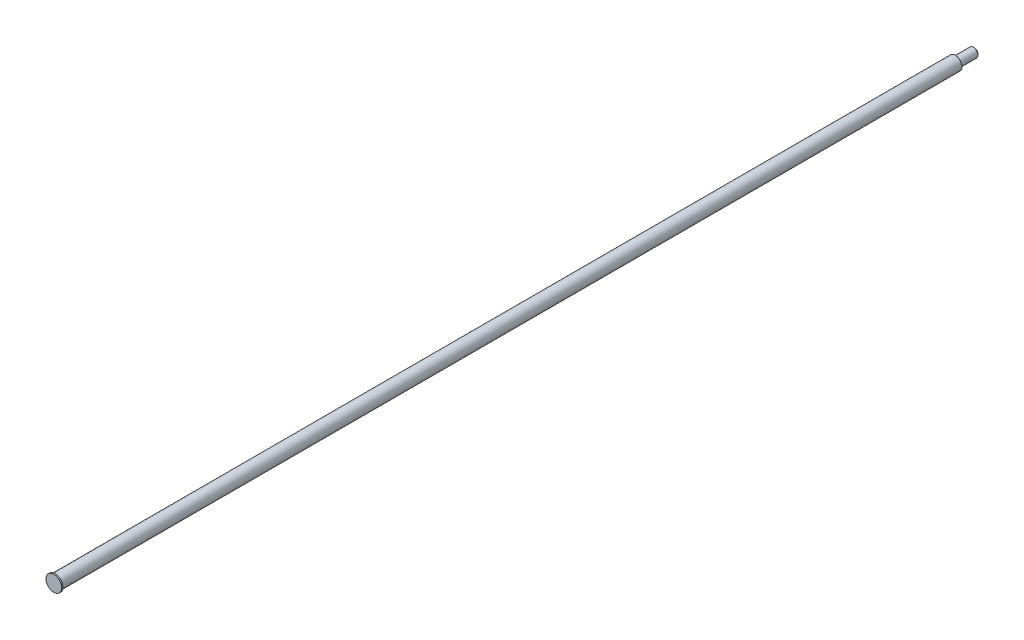
ISO-10303-21;
HEADER;
FILE_DESCRIPTION(('STEP AP214'),'2;1');
FILE_NAME('part.step','',(''),(''),'','','');
FILE_SCHEMA(('AUTOMOTIVE_DESIGN { 1 0 10303 214 1 1 1 1 }'));
ENDSEC;
DATA;
#1=APPLICATION_CONTEXT('core data for automotive mechanical design processes');
#2=APPLICATION_PROTOCOL_DEFINITION('international standard','automotive_design',2000,#1);
#3=PRODUCT_CONTEXT('',#1,'mechanical');
#4=PRODUCT('Part','Part','',(#3));
#5=PRODUCT_RELATED_PRODUCT_CATEGORY('part','',(#4));
#6=PRODUCT_DEFINITION_FORMATION('','',#4);
#7=PRODUCT_DEFINITION_CONTEXT('part definition',#1,'design');
#8=PRODUCT_DEFINITION('design','',#6,#7);
#9=PRODUCT_DEFINITION_SHAPE('','',#8);
#10=(LENGTH_UNIT() NAMED_UNIT(*) SI_UNIT(.MILLI.,.METRE.));
#11=(NAMED_UNIT(*) PLANE_ANGLE_UNIT() SI_UNIT($,.RADIAN.));
#12=(NAMED_UNIT(*) SI_UNIT($,.STERADIAN.) SOLID_ANGLE_UNIT());
#13=UNCERTAINTY_MEASURE_WITH_UNIT(LENGTH_MEASURE(1.E-05),#10,'distance_accuracy_value','');
#14=(GEOMETRIC_REPRESENTATION_CONTEXT(3) GLOBAL_UNCERTAINTY_ASSIGNED_CONTEXT((#13)) GLOBAL_UNIT_ASSIGNED_CONTEXT((#10,
#11,#12)) REPRESENTATION_CONTEXT('',''));
#15=CARTESIAN_POINT('',(0.,0.,0.));
#16=DIRECTION('',(0.,0.,1.));
#17=DIRECTION('',(1.,0.,0.));
#18=AXIS2_PLACEMENT_3D('',#15,#16,#17);
#19=CARTESIAN_POINT('',(0.,4.75000000000005,-1203.1002));
#20=DIRECTION('',(0.,0.,-1.));
#21=DIRECTION('',(-1.,0.,0.));
#22=AXIS2_PLACEMENT_3D('',#19,#20,#21);
#23=PLANE('',#22);
#24=CARTESIAN_POINT('',(0.,0.,-1203.10019999999));
#25=DIRECTION('',(0.,0.,1.));
#26=DIRECTION('',(1.,0.,0.));
#27=AXIS2_PLACEMENT_3D('',#24,#25,#26);
#28=CIRCLE('',#27,4.75000000000136);
#29=CARTESIAN_POINT('',(4.75000000000136,0.,-1203.10019999999));
#30=VERTEX_POINT('',#29);
#31=EDGE_CURVE('E17',#30,#30,#28,.T.);
#32=ORIENTED_EDGE('',*,*,#31,.F.);
#33=EDGE_LOOP('',(#32));
#34=FACE_BOUND('',#33,.T.);
#35=ADVANCED_FACE('F14',(#34),#23,.T.);
#36=CARTESIAN_POINT('',(0.,0.,-1201.85019999997));
#37=DIRECTION('',(0.,0.,1.));
#38=DIRECTION('',(1.,0.,0.));
#39=AXIS2_PLACEMENT_3D('',#36,#37,#38);
#40=CONICAL_SURFACE('',#39,6.00000000002865,0.785398163397448);
#41=ORIENTED_EDGE('',*,*,#31,.T.);
#42=EDGE_LOOP('',(#41));
#43=FACE_BOUND('',#42,.T.);
#44=CARTESIAN_POINT('',(0.,0.,-1201.8502));
#45=DIRECTION('',(0.,0.,-1.));
#46=DIRECTION('',(-1.,0.,0.));
#47=AXIS2_PLACEMENT_3D('',#44,#45,#46);
#48=CIRCLE('',#47,6.0000000000001);
#49=CARTESIAN_POINT('',(-6.0000000000001,0.,-1201.8502));
#50=VERTEX_POINT('',#49);
#51=EDGE_CURVE('E29',#50,#50,#48,.F.);
#52=ORIENTED_EDGE('',*,*,#51,.F.);
#53=EDGE_LOOP('',(#52));
#54=FACE_BOUND('',#53,.T.);
#55=ADVANCED_FACE('F48',(#43,#54),#40,.T.);
#56=CARTESIAN_POINT('',(0.,0.,0.));
#57=DIRECTION('',(0.,0.,1.));
#58=DIRECTION('',(1.,0.,0.));
#59=AXIS2_PLACEMENT_3D('',#56,#57,#58);
#60=PLANE('',#59);
#61=CARTESIAN_POINT('',(0.,0.,0.));
#62=DIRECTION('',(0.,0.,-1.));
#63=DIRECTION('',(-1.,0.,0.));
#64=AXIS2_PLACEMENT_3D('',#61,#62,#63);
#65=CIRCLE('',#64,10.25);
#66=CARTESIAN_POINT('',(-10.25,0.,0.));
#67=VERTEX_POINT('',#66);
#68=EDGE_CURVE('E37',#67,#67,#65,.T.);
#69=ORIENTED_EDGE('',*,*,#68,.F.);
#70=EDGE_LOOP('',(#69));
#71=FACE_BOUND('',#70,.T.);
#72=ADVANCED_FACE('F56',(#71),#60,.T.);
#73=CARTESIAN_POINT('',(0.,0.,0.));
#74=DIRECTION('',(0.,0.,-1.));
#75=DIRECTION('',(-1.,0.,0.));
#76=AXIS2_PLACEMENT_3D('',#73,#74,#75);
#77=CYLINDRICAL_SURFACE('',#76,6.0000000000001);
#78=CARTESIAN_POINT('',(0.,0.,-1179.35019999999));
#79=DIRECTION('',(0.,0.,-1.));
#80=DIRECTION('',(-1.,0.,0.));
#81=AXIS2_PLACEMENT_3D('',#78,#79,#80);
#82=CIRCLE('',#81,5.99999999997181);
#83=CARTESIAN_POINT('',(-5.99999999997181,0.,-1179.35019999999));
#84=VERTEX_POINT('',#83);
#85=EDGE_CURVE('E36',#84,#84,#82,.F.);
#86=ORIENTED_EDGE('',*,*,#85,.F.);
#87=EDGE_LOOP('',(#86));
#88=FACE_BOUND('',#87,.T.);
#89=ORIENTED_EDGE('',*,*,#51,.T.);
#90=EDGE_LOOP('',(#89));
#91=FACE_BOUND('',#90,.T.);
#92=ADVANCED_FACE('F79',(#88,#91),#77,.T.);
#93=CARTESIAN_POINT('',(0.,0.,0.));
#94=DIRECTION('',(0.,0.,-1.));
#95=DIRECTION('',(-1.,0.,0.));
#96=AXIS2_PLACEMENT_3D('',#93,#94,#95);
#97=CYLINDRICAL_SURFACE('',#96,10.25);
#98=ORIENTED_EDGE('',*,*,#68,.T.);
#99=EDGE_LOOP('',(#98));
#100=FACE_BOUND('',#99,.T.);
#101=CARTESIAN_POINT('',(0.,0.,-1.6002));
#102=DIRECTION('',(0.,0.,-1.));
#103=DIRECTION('',(-1.,0.,0.));
#104=AXIS2_PLACEMENT_3D('',#101,#102,#103);
#105=CIRCLE('',#104,10.25);
#106=CARTESIAN_POINT('',(-10.25,0.,-1.6002));
#107=VERTEX_POINT('',#106);
#108=EDGE_CURVE('E34',#107,#107,#105,.T.);
#109=ORIENTED_EDGE('',*,*,#108,.F.);
#110=EDGE_LOOP('',(#109));
#111=FACE_BOUND('',#110,.T.);
#112=ADVANCED_FACE('F75',(#100,#111),#97,.T.);
#113=CARTESIAN_POINT('',(0.,0.,-1179.35019999999));
#114=DIRECTION('',(0.,0.,-1.));
#115=DIRECTION('',(-1.,0.,0.));
#116=AXIS2_PLACEMENT_3D('',#113,#114,#115);
#117=CONICAL_SURFACE('',#116,5.99999999997181,0.785398163397448);
#118=CARTESIAN_POINT('',(0.,0.,-1178.10019999996));
#119=DIRECTION('',(0.,0.,-1.));
#120=DIRECTION('',(-1.,0.,0.));
#121=AXIS2_PLACEMENT_3D('',#118,#119,#120);
#122=CIRCLE('',#121,4.74999999994452);
#123=CARTESIAN_POINT('',(-4.74999999994452,0.,-1178.10019999996));
#124=VERTEX_POINT('',#123);
#125=EDGE_CURVE('E26',#124,#124,#122,.F.);
#126=ORIENTED_EDGE('',*,*,#125,.F.);
#127=EDGE_LOOP('',(#126));
#128=FACE_BOUND('',#127,.T.);
#129=ORIENTED_EDGE('',*,*,#85,.T.);
#130=EDGE_LOOP('',(#129));
#131=FACE_BOUND('',#130,.T.);
#132=ADVANCED_FACE('F71',(#128,#131),#117,.T.);
#133=CARTESIAN_POINT('',(0.,10.25,-1.6002));
#134=DIRECTION('',(0.,0.,-1.));
#135=DIRECTION('',(-1.,0.,0.));
#136=AXIS2_PLACEMENT_3D('',#133,#134,#135);
#137=PLANE('',#136);
#138=CARTESIAN_POINT('',(0.,0.,-1.6002));
#139=DIRECTION('',(0.,0.,-1.));
#140=DIRECTION('',(-1.,0.,0.));
#141=AXIS2_PLACEMENT_3D('',#138,#139,#140);
#142=CIRCLE('',#141,8.75);
#143=CARTESIAN_POINT('',(-8.75,0.,-1.6002));
#144=VERTEX_POINT('',#143);
#145=EDGE_CURVE('E21',#144,#144,#142,.T.);
#146=ORIENTED_EDGE('',*,*,#145,.F.);
#147=EDGE_LOOP('',(#146));
#148=FACE_BOUND('',#147,.T.);
#149=ORIENTED_EDGE('',*,*,#108,.T.);
#150=EDGE_LOOP('',(#149));
#151=FACE_BOUND('',#150,.T.);
#152=ADVANCED_FACE('F64',(#148,#151),#137,.T.);
#153=CARTESIAN_POINT('',(0.,8.75,-1178.1002));
#154=DIRECTION('',(0.,0.,-1.));
#155=DIRECTION('',(-1.,0.,0.));
#156=AXIS2_PLACEMENT_3D('',#153,#154,#155);
#157=PLANE('',#156);
#158=ORIENTED_EDGE('',*,*,#125,.T.);
#159=EDGE_LOOP('',(#158));
#160=FACE_BOUND('',#159,.T.);
#161=CARTESIAN_POINT('',(0.,0.,-1178.1002));
#162=DIRECTION('',(0.,0.,-1.));
#163=DIRECTION('',(-1.,0.,0.));
#164=AXIS2_PLACEMENT_3D('',#161,#162,#163);
#165=CIRCLE('',#164,8.75);
#166=CARTESIAN_POINT('',(-8.75,0.,-1178.1002));
#167=VERTEX_POINT('',#166);
#168=EDGE_CURVE('E10',#167,#167,#165,.F.);
#169=ORIENTED_EDGE('',*,*,#168,.F.);
#170=EDGE_LOOP('',(#169));
#171=FACE_BOUND('',#170,.T.);
#172=ADVANCED_FACE('F59',(#160,#171),#157,.T.);
#173=CARTESIAN_POINT('',(0.,0.,0.));
#174=DIRECTION('',(0.,0.,-1.));
#175=DIRECTION('',(-1.,0.,0.));
#176=AXIS2_PLACEMENT_3D('',#173,#174,#175);
#177=CYLINDRICAL_SURFACE('',#176,8.75);
#178=ORIENTED_EDGE('',*,*,#168,.T.);
#179=EDGE_LOOP('',(#178));
#180=FACE_BOUND('',#179,.T.);
#181=ORIENTED_EDGE('',*,*,#145,.T.);
#182=EDGE_LOOP('',(#181));
#183=FACE_BOUND('',#182,.T.);
#184=ADVANCED_FACE('F57',(#180,#183),#177,.T.);
#185=CLOSED_SHELL('',(#35,#55,#72,#92,#112,#132,#152,#172,#184));
#186=MANIFOLD_SOLID_BREP('B1',#185);
#187=ADVANCED_BREP_SHAPE_REPRESENTATION('',(#18,#186),#14);
#188=SHAPE_DEFINITION_REPRESENTATION(#9,#187);
ENDSEC;
END-ISO-10303-21;
